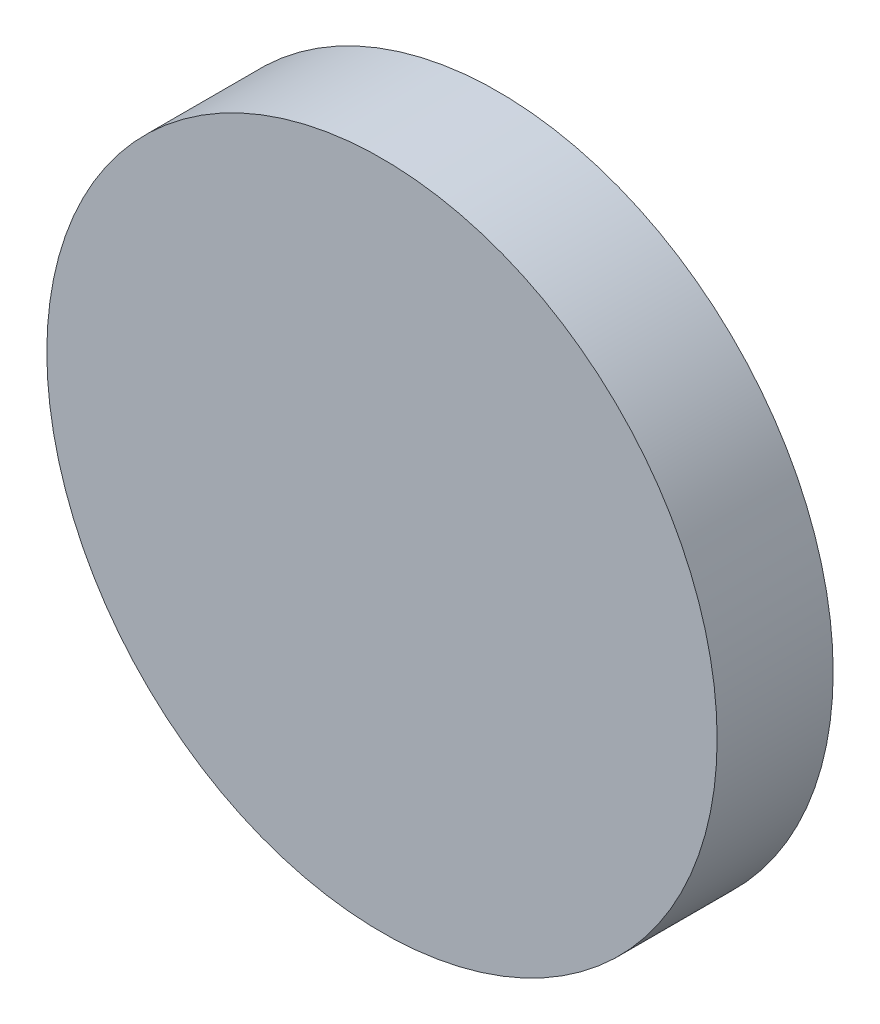
ISO-10303-21;
HEADER;
FILE_DESCRIPTION(('STEP AP214'),'2;1');
FILE_NAME('part.step','',(''),(''),'','','');
FILE_SCHEMA(('AUTOMOTIVE_DESIGN { 1 0 10303 214 1 1 1 1 }'));
ENDSEC;
DATA;
#1=APPLICATION_CONTEXT('core data for automotive mechanical design processes');
#2=APPLICATION_PROTOCOL_DEFINITION('international standard','automotive_design',2000,#1);
#3=PRODUCT_CONTEXT('',#1,'mechanical');
#4=PRODUCT('Part','Part','',(#3));
#5=PRODUCT_RELATED_PRODUCT_CATEGORY('part','',(#4));
#6=PRODUCT_DEFINITION_FORMATION('','',#4);
#7=PRODUCT_DEFINITION_CONTEXT('part definition',#1,'design');
#8=PRODUCT_DEFINITION('design','',#6,#7);
#9=PRODUCT_DEFINITION_SHAPE('','',#8);
#10=(LENGTH_UNIT() NAMED_UNIT(*) SI_UNIT(.MILLI.,.METRE.));
#11=(NAMED_UNIT(*) PLANE_ANGLE_UNIT() SI_UNIT($,.RADIAN.));
#12=(NAMED_UNIT(*) SI_UNIT($,.STERADIAN.) SOLID_ANGLE_UNIT());
#13=UNCERTAINTY_MEASURE_WITH_UNIT(LENGTH_MEASURE(1.E-05),#10,'distance_accuracy_value','');
#14=(GEOMETRIC_REPRESENTATION_CONTEXT(3) GLOBAL_UNCERTAINTY_ASSIGNED_CONTEXT((#13)) GLOBAL_UNIT_ASSIGNED_CONTEXT((#10,
#11,#12)) REPRESENTATION_CONTEXT('',''));
#15=CARTESIAN_POINT('',(0.,0.,0.));
#16=DIRECTION('',(0.,0.,1.));
#17=DIRECTION('',(1.,0.,0.));
#18=AXIS2_PLACEMENT_3D('',#15,#16,#17);
#19=CARTESIAN_POINT('',(0.,0.,573.75));
#20=DIRECTION('',(0.,0.,-1.));
#21=DIRECTION('',(-1.,0.,0.));
#22=AXIS2_PLACEMENT_3D('',#19,#20,#21);
#23=CYLINDRICAL_SURFACE('',#22,3250.);
#24=CARTESIAN_POINT('',(0.,0.,573.75));
#25=DIRECTION('',(0.,0.,1.));
#26=DIRECTION('',(1.,0.,0.));
#27=AXIS2_PLACEMENT_3D('',#24,#25,#26);
#28=CIRCLE('',#27,3250.);
#29=CARTESIAN_POINT('',(3250.,0.,573.75));
#30=VERTEX_POINT('',#29);
#31=EDGE_CURVE('E10',#30,#30,#28,.T.);
#32=ORIENTED_EDGE('',*,*,#31,.F.);
#33=EDGE_LOOP('',(#32));
#34=FACE_BOUND('',#33,.T.);
#35=CARTESIAN_POINT('',(0.,0.,-551.25));
#36=DIRECTION('',(0.,0.,1.));
#37=DIRECTION('',(1.,0.,0.));
#38=AXIS2_PLACEMENT_3D('',#35,#36,#37);
#39=CIRCLE('',#38,3250.);
#40=CARTESIAN_POINT('',(3250.,0.,-551.25));
#41=VERTEX_POINT('',#40);
#42=EDGE_CURVE('E43',#41,#41,#39,.T.);
#43=ORIENTED_EDGE('',*,*,#42,.T.);
#44=EDGE_LOOP('',(#43));
#45=FACE_BOUND('',#44,.T.);
#46=ADVANCED_FACE('F40',(#34,#45),#23,.T.);
#47=CARTESIAN_POINT('',(0.,0.,573.75));
#48=DIRECTION('',(0.,0.,1.));
#49=DIRECTION('',(1.,0.,0.));
#50=AXIS2_PLACEMENT_3D('',#47,#48,#49);
#51=PLANE('',#50);
#52=ORIENTED_EDGE('',*,*,#31,.T.);
#53=EDGE_LOOP('',(#52));
#54=FACE_BOUND('',#53,.T.);
#55=ADVANCED_FACE('F55',(#54),#51,.T.);
#56=CARTESIAN_POINT('',(0.,0.,-551.25));
#57=DIRECTION('',(0.,0.,1.));
#58=DIRECTION('',(1.,0.,0.));
#59=AXIS2_PLACEMENT_3D('',#56,#57,#58);
#60=PLANE('',#59);
#61=ORIENTED_EDGE('',*,*,#42,.F.);
#62=EDGE_LOOP('',(#61));
#63=FACE_BOUND('',#62,.T.);
#64=ADVANCED_FACE('F53',(#63),#60,.F.);
#65=CLOSED_SHELL('',(#46,#55,#64));
#66=MANIFOLD_SOLID_BREP('B2',#65);
#67=ADVANCED_BREP_SHAPE_REPRESENTATION('',(#18,#66),#14);
#68=SHAPE_DEFINITION_REPRESENTATION(#9,#67);
ENDSEC;
END-ISO-10303-21;
